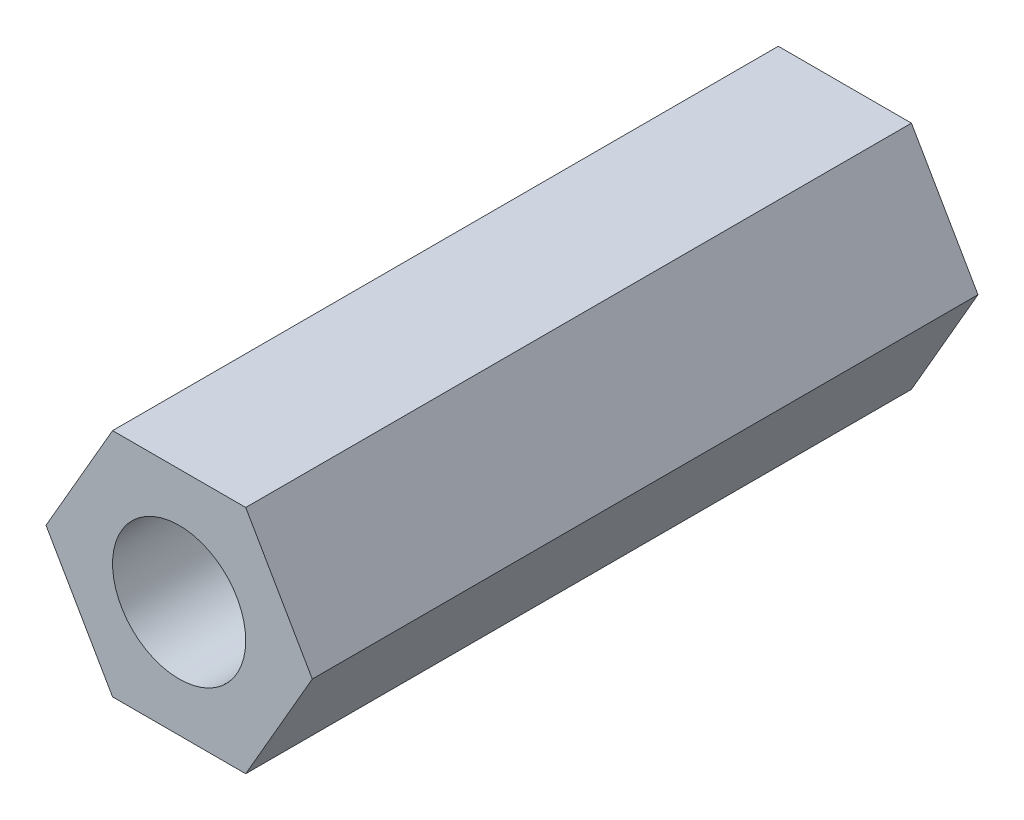
ISO-10303-21;
HEADER;
FILE_DESCRIPTION(('STEP AP214'),'2;1');
FILE_NAME('part.step','',(''),(''),'','','');
FILE_SCHEMA(('AUTOMOTIVE_DESIGN { 1 0 10303 214 1 1 1 1 }'));
ENDSEC;
DATA;
#1=APPLICATION_CONTEXT('core data for automotive mechanical design processes');
#2=APPLICATION_PROTOCOL_DEFINITION('international standard','automotive_design',2000,#1);
#3=PRODUCT_CONTEXT('',#1,'mechanical');
#4=PRODUCT('Part','Part','',(#3));
#5=PRODUCT_RELATED_PRODUCT_CATEGORY('part','',(#4));
#6=PRODUCT_DEFINITION_FORMATION('','',#4);
#7=PRODUCT_DEFINITION_CONTEXT('part definition',#1,'design');
#8=PRODUCT_DEFINITION('design','',#6,#7);
#9=PRODUCT_DEFINITION_SHAPE('','',#8);
#10=(LENGTH_UNIT() NAMED_UNIT(*) SI_UNIT(.MILLI.,.METRE.));
#11=(NAMED_UNIT(*) PLANE_ANGLE_UNIT() SI_UNIT($,.RADIAN.));
#12=(NAMED_UNIT(*) SI_UNIT($,.STERADIAN.) SOLID_ANGLE_UNIT());
#13=UNCERTAINTY_MEASURE_WITH_UNIT(LENGTH_MEASURE(1.E-05),#10,'distance_accuracy_value','');
#14=(GEOMETRIC_REPRESENTATION_CONTEXT(3) GLOBAL_UNCERTAINTY_ASSIGNED_CONTEXT((#13)) GLOBAL_UNIT_ASSIGNED_CONTEXT((#10,
#11,#12)) REPRESENTATION_CONTEXT('',''));
#15=CARTESIAN_POINT('',(0.,0.,0.));
#16=DIRECTION('',(0.,0.,1.));
#17=DIRECTION('',(1.,0.,0.));
#18=AXIS2_PLACEMENT_3D('',#15,#16,#17);
#19=CARTESIAN_POINT('',(0.,0.,15.));
#20=DIRECTION('',(0.,0.,1.));
#21=DIRECTION('',(1.,0.,0.));
#22=AXIS2_PLACEMENT_3D('',#19,#20,#21);
#23=PLANE('',#22);
#24=DIRECTION('',(-0.499897242758475,0.86608472257769,0.));
#25=VECTOR('',#24,1.);
#26=CARTESIAN_POINT('',(2.99999997888335,-0.000355949334629197,15.));
#27=LINE('',#26,#25);
#28=CARTESIAN_POINT('',(2.99999997888335,-0.000355949334629197,15.));
#29=VERTEX_POINT('',#28);
#30=CARTESIAN_POINT('',(1.50030825060792,2.59789821839844,15.));
#31=VERTEX_POINT('',#30);
#32=EDGE_CURVE('E146',#29,#31,#27,.T.);
#33=ORIENTED_EDGE('',*,*,#32,.T.);
#34=DIRECTION('',(-0.999999992961115,0.000118649778209443,0.));
#35=VECTOR('',#34,1.);
#36=CARTESIAN_POINT('',(1.50030825060792,2.59789821839844,15.));
#37=LINE('',#36,#35);
#38=CARTESIAN_POINT('',(-1.49969172827542,2.59825416773307,15.));
#39=VERTEX_POINT('',#38);
#40=EDGE_CURVE('E94',#31,#39,#37,.T.);
#41=ORIENTED_EDGE('',*,*,#40,.T.);
#42=DIRECTION('',(-0.500102750202641,-0.86596607279948,0.));
#43=VECTOR('',#42,1.);
#44=CARTESIAN_POINT('',(-1.49969172827542,2.59825416773307,15.));
#45=LINE('',#44,#43);
#46=CARTESIAN_POINT('',(-2.99999997888335,0.000355949334627463,15.));
#47=VERTEX_POINT('',#46);
#48=EDGE_CURVE('E107',#39,#47,#45,.T.);
#49=ORIENTED_EDGE('',*,*,#48,.T.);
#50=DIRECTION('',(0.499897242758475,-0.86608472257769,0.));
#51=VECTOR('',#50,1.);
#52=CARTESIAN_POINT('',(-2.99999997888335,0.000355949334627463,15.));
#53=LINE('',#52,#51);
#54=CARTESIAN_POINT('',(-1.50030825060792,-2.59789821839844,15.));
#55=VERTEX_POINT('',#54);
#56=EDGE_CURVE('E101',#47,#55,#53,.T.);
#57=ORIENTED_EDGE('',*,*,#56,.T.);
#58=DIRECTION('',(0.999999992961115,-0.000118649778209443,0.));
#59=VECTOR('',#58,1.);
#60=CARTESIAN_POINT('',(-1.50030825060792,-2.59789821839844,15.));
#61=LINE('',#60,#59);
#62=CARTESIAN_POINT('',(1.49969172827542,-2.59825416773307,15.));
#63=VERTEX_POINT('',#62);
#64=EDGE_CURVE('E105',#55,#63,#61,.T.);
#65=ORIENTED_EDGE('',*,*,#64,.T.);
#66=DIRECTION('',(0.500102750202641,0.865966072799481,0.));
#67=VECTOR('',#66,1.);
#68=CARTESIAN_POINT('',(1.49969172827542,-2.59825416773307,15.));
#69=LINE('',#68,#67);
#70=EDGE_CURVE('E57',#63,#29,#69,.T.);
#71=ORIENTED_EDGE('',*,*,#70,.T.);
#72=EDGE_LOOP('',(#33,#41,#49,#57,#65,#71));
#73=FACE_BOUND('',#72,.T.);
#74=CARTESIAN_POINT('',(0.,0.,15.));
#75=DIRECTION('',(0.,0.,1.));
#76=DIRECTION('',(1.,0.,0.));
#77=AXIS2_PLACEMENT_3D('',#74,#75,#76);
#78=CIRCLE('',#77,1.5);
#79=CARTESIAN_POINT('',(1.5,0.,15.));
#80=VERTEX_POINT('',#79);
#81=EDGE_CURVE('E134',#80,#80,#78,.T.);
#82=ORIENTED_EDGE('',*,*,#81,.F.);
#83=EDGE_LOOP('',(#82));
#84=FACE_BOUND('',#83,.T.);
#85=ADVANCED_FACE('F39',(#73,#84),#23,.T.);
#86=CARTESIAN_POINT('',(0.,0.,0.));
#87=DIRECTION('',(0.,0.,1.));
#88=DIRECTION('',(1.,0.,0.));
#89=AXIS2_PLACEMENT_3D('',#86,#87,#88);
#90=PLANE('',#89);
#91=DIRECTION('',(-0.499897242758475,0.86608472257769,0.));
#92=VECTOR('',#91,1.);
#93=CARTESIAN_POINT('',(2.99999997888335,-0.000355949334629197,0.));
#94=LINE('',#93,#92);
#95=CARTESIAN_POINT('',(2.99999997888335,-0.000355949334629197,0.));
#96=VERTEX_POINT('',#95);
#97=CARTESIAN_POINT('',(1.50030825060792,2.59789821839844,0.));
#98=VERTEX_POINT('',#97);
#99=EDGE_CURVE('E129',#96,#98,#94,.T.);
#100=ORIENTED_EDGE('',*,*,#99,.F.);
#101=DIRECTION('',(0.500102750202641,0.865966072799481,0.));
#102=VECTOR('',#101,1.);
#103=CARTESIAN_POINT('',(1.49969172827542,-2.59825416773307,0.));
#104=LINE('',#103,#102);
#105=CARTESIAN_POINT('',(1.49969172827542,-2.59825416773307,0.));
#106=VERTEX_POINT('',#105);
#107=EDGE_CURVE('E86',#106,#96,#104,.T.);
#108=ORIENTED_EDGE('',*,*,#107,.F.);
#109=DIRECTION('',(0.999999992961115,-0.000118649778209443,0.));
#110=VECTOR('',#109,1.);
#111=CARTESIAN_POINT('',(-1.50030825060792,-2.59789821839844,0.));
#112=LINE('',#111,#110);
#113=CARTESIAN_POINT('',(-1.50030825060792,-2.59789821839844,0.));
#114=VERTEX_POINT('',#113);
#115=EDGE_CURVE('E80',#114,#106,#112,.T.);
#116=ORIENTED_EDGE('',*,*,#115,.F.);
#117=DIRECTION('',(0.499897242758475,-0.86608472257769,0.));
#118=VECTOR('',#117,1.);
#119=CARTESIAN_POINT('',(-2.99999997888335,0.000355949334627463,0.));
#120=LINE('',#119,#118);
#121=CARTESIAN_POINT('',(-2.99999997888335,0.000355949334627463,0.));
#122=VERTEX_POINT('',#121);
#123=EDGE_CURVE('E116',#122,#114,#120,.T.);
#124=ORIENTED_EDGE('',*,*,#123,.F.);
#125=DIRECTION('',(-0.500102750202641,-0.86596607279948,0.));
#126=VECTOR('',#125,1.);
#127=CARTESIAN_POINT('',(-1.49969172827542,2.59825416773307,0.));
#128=LINE('',#127,#126);
#129=CARTESIAN_POINT('',(-1.49969172827542,2.59825416773307,0.));
#130=VERTEX_POINT('',#129);
#131=EDGE_CURVE('E137',#130,#122,#128,.T.);
#132=ORIENTED_EDGE('',*,*,#131,.F.);
#133=DIRECTION('',(-0.999999992961115,0.000118649778209443,0.));
#134=VECTOR('',#133,1.);
#135=CARTESIAN_POINT('',(1.50030825060792,2.59789821839844,0.));
#136=LINE('',#135,#134);
#137=EDGE_CURVE('E133',#98,#130,#136,.T.);
#138=ORIENTED_EDGE('',*,*,#137,.F.);
#139=EDGE_LOOP('',(#100,#108,#116,#124,#132,#138));
#140=FACE_BOUND('',#139,.T.);
#141=CARTESIAN_POINT('',(0.,0.,0.));
#142=DIRECTION('',(0.,0.,1.));
#143=DIRECTION('',(1.,0.,0.));
#144=AXIS2_PLACEMENT_3D('',#141,#142,#143);
#145=CIRCLE('',#144,1.5);
#146=CARTESIAN_POINT('',(1.5,0.,0.));
#147=VERTEX_POINT('',#146);
#148=EDGE_CURVE('E243',#147,#147,#145,.T.);
#149=ORIENTED_EDGE('',*,*,#148,.T.);
#150=EDGE_LOOP('',(#149));
#151=FACE_BOUND('',#150,.T.);
#152=ADVANCED_FACE('F159',(#140,#151),#90,.F.);
#153=CARTESIAN_POINT('',(2.99999997888335,-0.000355949334629197,15.));
#154=DIRECTION('',(-0.86608472257769,-0.499897242758475,0.));
#155=DIRECTION('',(0.499897242758475,-0.86608472257769,0.));
#156=AXIS2_PLACEMENT_3D('',#153,#154,#155);
#157=PLANE('',#156);
#158=ORIENTED_EDGE('',*,*,#99,.T.);
#159=DIRECTION('',(0.,0.,-1.));
#160=VECTOR('',#159,1.);
#161=CARTESIAN_POINT('',(1.50030825060792,2.59789821839844,15.));
#162=LINE('',#161,#160);
#163=EDGE_CURVE('E11',#31,#98,#162,.T.);
#164=ORIENTED_EDGE('',*,*,#163,.F.);
#165=ORIENTED_EDGE('',*,*,#32,.F.);
#166=DIRECTION('',(0.,0.,-1.));
#167=VECTOR('',#166,1.);
#168=CARTESIAN_POINT('',(2.99999997888335,-0.000355949334629197,15.));
#169=LINE('',#168,#167);
#170=EDGE_CURVE('E125',#29,#96,#169,.T.);
#171=ORIENTED_EDGE('',*,*,#170,.T.);
#172=EDGE_LOOP('',(#158,#164,#165,#171));
#173=FACE_BOUND('',#172,.T.);
#174=ADVANCED_FACE('F41',(#173),#157,.F.);
#175=CARTESIAN_POINT('',(1.50030825060792,2.59789821839844,15.));
#176=DIRECTION('',(-0.000118649778209443,-0.999999992961115,0.));
#177=DIRECTION('',(0.999999992961115,-0.000118649778209443,0.));
#178=AXIS2_PLACEMENT_3D('',#175,#176,#177);
#179=PLANE('',#178);
#180=ORIENTED_EDGE('',*,*,#137,.T.);
#181=DIRECTION('',(0.,0.,-1.));
#182=VECTOR('',#181,1.);
#183=CARTESIAN_POINT('',(-1.49969172827542,2.59825416773307,15.));
#184=LINE('',#183,#182);
#185=EDGE_CURVE('E49',#39,#130,#184,.T.);
#186=ORIENTED_EDGE('',*,*,#185,.F.);
#187=ORIENTED_EDGE('',*,*,#40,.F.);
#188=ORIENTED_EDGE('',*,*,#163,.T.);
#189=EDGE_LOOP('',(#180,#186,#187,#188));
#190=FACE_BOUND('',#189,.T.);
#191=ADVANCED_FACE('F184',(#190),#179,.F.);
#192=CARTESIAN_POINT('',(-1.49969172827542,2.59825416773307,15.));
#193=DIRECTION('',(0.86596607279948,-0.500102750202641,0.));
#194=DIRECTION('',(0.500102750202641,0.865966072799481,0.));
#195=AXIS2_PLACEMENT_3D('',#192,#193,#194);
#196=PLANE('',#195);
#197=ORIENTED_EDGE('',*,*,#131,.T.);
#198=DIRECTION('',(0.,0.,-1.));
#199=VECTOR('',#198,1.);
#200=CARTESIAN_POINT('',(-2.99999997888335,0.000355949334627463,15.));
#201=LINE('',#200,#199);
#202=EDGE_CURVE('E118',#47,#122,#201,.T.);
#203=ORIENTED_EDGE('',*,*,#202,.F.);
#204=ORIENTED_EDGE('',*,*,#48,.F.);
#205=ORIENTED_EDGE('',*,*,#185,.T.);
#206=EDGE_LOOP('',(#197,#203,#204,#205));
#207=FACE_BOUND('',#206,.T.);
#208=ADVANCED_FACE('F156',(#207),#196,.F.);
#209=CARTESIAN_POINT('',(-2.99999997888335,0.000355949334627463,15.));
#210=DIRECTION('',(0.86608472257769,0.499897242758475,0.));
#211=DIRECTION('',(-0.499897242758475,0.86608472257769,0.));
#212=AXIS2_PLACEMENT_3D('',#209,#210,#211);
#213=PLANE('',#212);
#214=ORIENTED_EDGE('',*,*,#123,.T.);
#215=DIRECTION('',(0.,0.,-1.));
#216=VECTOR('',#215,1.);
#217=CARTESIAN_POINT('',(-1.50030825060792,-2.59789821839844,15.));
#218=LINE('',#217,#216);
#219=EDGE_CURVE('E113',#55,#114,#218,.T.);
#220=ORIENTED_EDGE('',*,*,#219,.F.);
#221=ORIENTED_EDGE('',*,*,#56,.F.);
#222=ORIENTED_EDGE('',*,*,#202,.T.);
#223=EDGE_LOOP('',(#214,#220,#221,#222));
#224=FACE_BOUND('',#223,.T.);
#225=ADVANCED_FACE('F114',(#224),#213,.F.);
#226=CARTESIAN_POINT('',(-1.50030825060792,-2.59789821839844,15.));
#227=DIRECTION('',(0.000118649778209443,0.999999992961115,0.));
#228=DIRECTION('',(-0.999999992961115,0.000118649778209443,0.));
#229=AXIS2_PLACEMENT_3D('',#226,#227,#228);
#230=PLANE('',#229);
#231=ORIENTED_EDGE('',*,*,#115,.T.);
#232=DIRECTION('',(0.,0.,-1.));
#233=VECTOR('',#232,1.);
#234=CARTESIAN_POINT('',(1.49969172827542,-2.59825416773307,15.));
#235=LINE('',#234,#233);
#236=EDGE_CURVE('E119',#63,#106,#235,.T.);
#237=ORIENTED_EDGE('',*,*,#236,.F.);
#238=ORIENTED_EDGE('',*,*,#64,.F.);
#239=ORIENTED_EDGE('',*,*,#219,.T.);
#240=EDGE_LOOP('',(#231,#237,#238,#239));
#241=FACE_BOUND('',#240,.T.);
#242=ADVANCED_FACE('F121',(#241),#230,.F.);
#243=CARTESIAN_POINT('',(1.49969172827542,-2.59825416773307,15.));
#244=DIRECTION('',(-0.865966072799481,0.500102750202641,0.));
#245=DIRECTION('',(-0.500102750202641,-0.865966072799481,0.));
#246=AXIS2_PLACEMENT_3D('',#243,#244,#245);
#247=PLANE('',#246);
#248=ORIENTED_EDGE('',*,*,#107,.T.);
#249=ORIENTED_EDGE('',*,*,#170,.F.);
#250=ORIENTED_EDGE('',*,*,#70,.F.);
#251=ORIENTED_EDGE('',*,*,#236,.T.);
#252=EDGE_LOOP('',(#248,#249,#250,#251));
#253=FACE_BOUND('',#252,.T.);
#254=ADVANCED_FACE('F164',(#253),#247,.F.);
#255=CARTESIAN_POINT('',(0.,0.,15.));
#256=DIRECTION('',(0.,0.,-1.));
#257=DIRECTION('',(-1.,0.,0.));
#258=AXIS2_PLACEMENT_3D('',#255,#256,#257);
#259=CYLINDRICAL_SURFACE('',#258,1.5);
#260=ORIENTED_EDGE('',*,*,#81,.T.);
#261=EDGE_LOOP('',(#260));
#262=FACE_BOUND('',#261,.T.);
#263=ORIENTED_EDGE('',*,*,#148,.F.);
#264=EDGE_LOOP('',(#263));
#265=FACE_BOUND('',#264,.T.);
#266=ADVANCED_FACE('F166',(#262,#265),#259,.F.);
#267=CLOSED_SHELL('',(#85,#152,#174,#191,#208,#225,#242,#254,#266));
#268=MANIFOLD_SOLID_BREP('B2',#267);
#269=ADVANCED_BREP_SHAPE_REPRESENTATION('',(#18,#268),#14);
#270=SHAPE_DEFINITION_REPRESENTATION(#9,#269);
ENDSEC;
END-ISO-10303-21;
